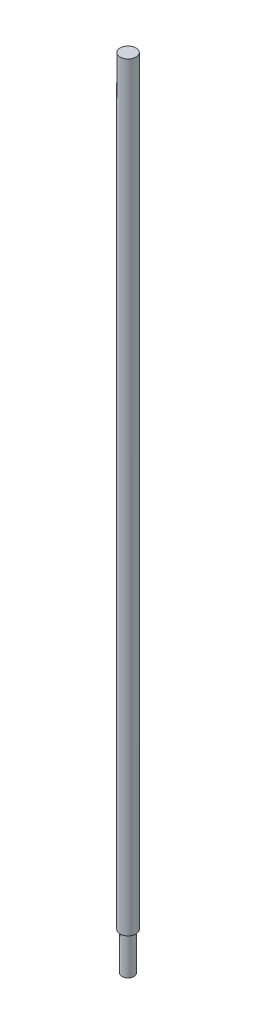
ISO-10303-21;
HEADER;
FILE_DESCRIPTION(('STEP AP214'),'2;1');
FILE_NAME('part.step','',(''),(''),'','','');
FILE_SCHEMA(('AUTOMOTIVE_DESIGN { 1 0 10303 214 1 1 1 1 }'));
ENDSEC;
DATA;
#1=APPLICATION_CONTEXT('core data for automotive mechanical design processes');
#2=APPLICATION_PROTOCOL_DEFINITION('international standard','automotive_design',2000,#1);
#3=PRODUCT_CONTEXT('',#1,'mechanical');
#4=PRODUCT('Part','Part','',(#3));
#5=PRODUCT_RELATED_PRODUCT_CATEGORY('part','',(#4));
#6=PRODUCT_DEFINITION_FORMATION('','',#4);
#7=PRODUCT_DEFINITION_CONTEXT('part definition',#1,'design');
#8=PRODUCT_DEFINITION('design','',#6,#7);
#9=PRODUCT_DEFINITION_SHAPE('','',#8);
#10=(LENGTH_UNIT() NAMED_UNIT(*) SI_UNIT(.MILLI.,.METRE.));
#11=(NAMED_UNIT(*) PLANE_ANGLE_UNIT() SI_UNIT($,.RADIAN.));
#12=(NAMED_UNIT(*) SI_UNIT($,.STERADIAN.) SOLID_ANGLE_UNIT());
#13=UNCERTAINTY_MEASURE_WITH_UNIT(LENGTH_MEASURE(1.E-05),#10,'distance_accuracy_value','');
#14=(GEOMETRIC_REPRESENTATION_CONTEXT(3) GLOBAL_UNCERTAINTY_ASSIGNED_CONTEXT((#13)) GLOBAL_UNIT_ASSIGNED_CONTEXT((#10,
#11,#12)) REPRESENTATION_CONTEXT('',''));
#15=CARTESIAN_POINT('',(0.,0.,0.));
#16=DIRECTION('',(0.,0.,1.));
#17=DIRECTION('',(1.,0.,0.));
#18=AXIS2_PLACEMENT_3D('',#15,#16,#17);
#19=CARTESIAN_POINT('',(0.,618.,0.));
#20=DIRECTION('',(0.,-1.,0.));
#21=DIRECTION('',(0.,0.,-1.));
#22=AXIS2_PLACEMENT_3D('',#19,#20,#21);
#23=CYLINDRICAL_SURFACE('',#22,4.);
#24=CARTESIAN_POINT('',(0.,618.,0.));
#25=DIRECTION('',(0.,1.,0.));
#26=DIRECTION('',(0.,0.,1.));
#27=AXIS2_PLACEMENT_3D('',#24,#25,#26);
#28=CIRCLE('',#27,4.);
#29=CARTESIAN_POINT('',(0.,618.,4.));
#30=VERTEX_POINT('',#29);
#31=EDGE_CURVE('E10',#30,#30,#28,.T.);
#32=ORIENTED_EDGE('',*,*,#31,.F.);
#33=EDGE_LOOP('',(#32));
#34=FACE_BOUND('',#33,.T.);
#35=CARTESIAN_POINT('',(0.,237.,0.));
#36=DIRECTION('',(0.,-1.,0.));
#37=DIRECTION('',(0.,0.,-1.));
#38=AXIS2_PLACEMENT_3D('',#35,#36,#37);
#39=CIRCLE('',#38,4.);
#40=CARTESIAN_POINT('',(0.,237.,-4.));
#41=VERTEX_POINT('',#40);
#42=EDGE_CURVE('E43',#41,#41,#39,.T.);
#43=ORIENTED_EDGE('',*,*,#42,.F.);
#44=EDGE_LOOP('',(#43));
#45=FACE_BOUND('',#44,.T.);
#46=ADVANCED_FACE('F37',(#34,#45),#23,.T.);
#47=CARTESIAN_POINT('',(0.,618.,0.));
#48=DIRECTION('',(0.,1.,0.));
#49=DIRECTION('',(0.,0.,1.));
#50=AXIS2_PLACEMENT_3D('',#47,#48,#49);
#51=PLANE('',#50);
#52=ORIENTED_EDGE('',*,*,#31,.T.);
#53=EDGE_LOOP('',(#52));
#54=FACE_BOUND('',#53,.T.);
#55=ADVANCED_FACE('F68',(#54),#51,.T.);
#56=CARTESIAN_POINT('',(0.,237.,0.));
#57=DIRECTION('',(0.,-1.,0.));
#58=DIRECTION('',(0.,0.,-1.));
#59=AXIS2_PLACEMENT_3D('',#56,#57,#58);
#60=PLANE('',#59);
#61=CARTESIAN_POINT('',(0.,237.,0.));
#62=DIRECTION('',(0.,-1.,0.));
#63=DIRECTION('',(0.,0.,-1.));
#64=AXIS2_PLACEMENT_3D('',#61,#62,#63);
#65=CIRCLE('',#64,3.);
#66=CARTESIAN_POINT('',(0.,237.,-3.));
#67=VERTEX_POINT('',#66);
#68=EDGE_CURVE('E47',#67,#67,#65,.T.);
#69=ORIENTED_EDGE('',*,*,#68,.F.);
#70=EDGE_LOOP('',(#69));
#71=FACE_BOUND('',#70,.T.);
#72=ORIENTED_EDGE('',*,*,#42,.T.);
#73=EDGE_LOOP('',(#72));
#74=FACE_BOUND('',#73,.T.);
#75=ADVANCED_FACE('F61',(#71,#74),#60,.T.);
#76=CARTESIAN_POINT('',(0.,237.,0.));
#77=DIRECTION('',(0.,-1.,0.));
#78=DIRECTION('',(0.,0.,-1.));
#79=AXIS2_PLACEMENT_3D('',#76,#77,#78);
#80=CYLINDRICAL_SURFACE('',#79,3.);
#81=ORIENTED_EDGE('',*,*,#68,.T.);
#82=EDGE_LOOP('',(#81));
#83=FACE_BOUND('',#82,.T.);
#84=CARTESIAN_POINT('',(0.,218.,0.));
#85=DIRECTION('',(0.,-1.,0.));
#86=DIRECTION('',(0.,0.,-1.));
#87=AXIS2_PLACEMENT_3D('',#84,#85,#86);
#88=CIRCLE('',#87,3.);
#89=CARTESIAN_POINT('',(0.,218.,-3.));
#90=VERTEX_POINT('',#89);
#91=EDGE_CURVE('E51',#90,#90,#88,.T.);
#92=ORIENTED_EDGE('',*,*,#91,.F.);
#93=EDGE_LOOP('',(#92));
#94=FACE_BOUND('',#93,.T.);
#95=ADVANCED_FACE('F59',(#83,#94),#80,.T.);
#96=CARTESIAN_POINT('',(0.,218.,0.));
#97=DIRECTION('',(0.,1.,0.));
#98=DIRECTION('',(0.,0.,1.));
#99=AXIS2_PLACEMENT_3D('',#96,#97,#98);
#100=PLANE('',#99);
#101=ORIENTED_EDGE('',*,*,#91,.T.);
#102=EDGE_LOOP('',(#101));
#103=FACE_BOUND('',#102,.T.);
#104=ADVANCED_FACE('F57',(#103),#100,.F.);
#105=CLOSED_SHELL('',(#46,#55,#75,#95,#104));
#106=MANIFOLD_SOLID_BREP('B2',#105);
#107=ADVANCED_BREP_SHAPE_REPRESENTATION('',(#18,#106),#14);
#108=SHAPE_DEFINITION_REPRESENTATION(#9,#107);
ENDSEC;
END-ISO-10303-21;
